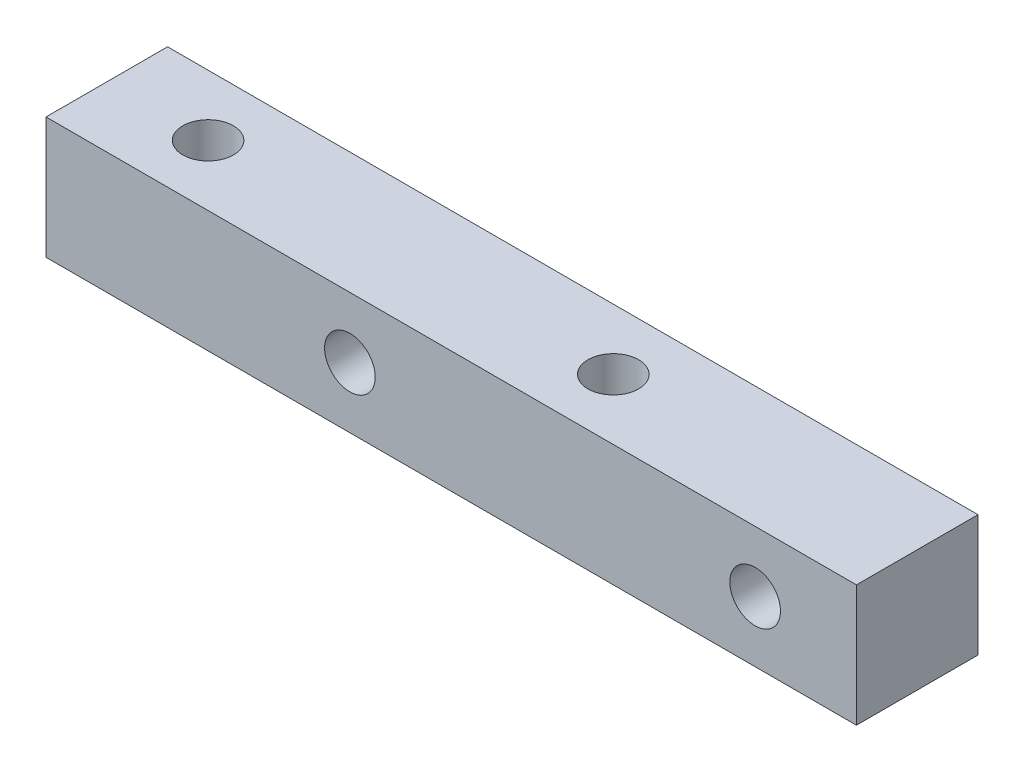
ISO-10303-21;
HEADER;
FILE_DESCRIPTION(('STEP AP214'),'2;1');
FILE_NAME('part.step','',(''),(''),'','','');
FILE_SCHEMA(('AUTOMOTIVE_DESIGN { 1 0 10303 214 1 1 1 1 }'));
ENDSEC;
DATA;
#1=APPLICATION_CONTEXT('core data for automotive mechanical design processes');
#2=APPLICATION_PROTOCOL_DEFINITION('international standard','automotive_design',2000,#1);
#3=PRODUCT_CONTEXT('',#1,'mechanical');
#4=PRODUCT('Part','Part','',(#3));
#5=PRODUCT_RELATED_PRODUCT_CATEGORY('part','',(#4));
#6=PRODUCT_DEFINITION_FORMATION('','',#4);
#7=PRODUCT_DEFINITION_CONTEXT('part definition',#1,'design');
#8=PRODUCT_DEFINITION('design','',#6,#7);
#9=PRODUCT_DEFINITION_SHAPE('','',#8);
#10=(LENGTH_UNIT() NAMED_UNIT(*) SI_UNIT(.MILLI.,.METRE.));
#11=(NAMED_UNIT(*) PLANE_ANGLE_UNIT() SI_UNIT($,.RADIAN.));
#12=(NAMED_UNIT(*) SI_UNIT($,.STERADIAN.) SOLID_ANGLE_UNIT());
#13=UNCERTAINTY_MEASURE_WITH_UNIT(LENGTH_MEASURE(1.E-05),#10,'distance_accuracy_value','');
#14=(GEOMETRIC_REPRESENTATION_CONTEXT(3) GLOBAL_UNCERTAINTY_ASSIGNED_CONTEXT((#13)) GLOBAL_UNIT_ASSIGNED_CONTEXT((#10,
#11,#12)) REPRESENTATION_CONTEXT('',''));
#15=CARTESIAN_POINT('',(0.,0.,0.));
#16=DIRECTION('',(0.,0.,1.));
#17=DIRECTION('',(1.,0.,0.));
#18=AXIS2_PLACEMENT_3D('',#15,#16,#17);
#19=CARTESIAN_POINT('',(0.,6.,0.));
#20=DIRECTION('',(0.,-1.,0.));
#21=DIRECTION('',(0.,0.,-1.));
#22=AXIS2_PLACEMENT_3D('',#19,#20,#21);
#23=PLANE('',#22);
#24=DIRECTION('',(0.,0.,-1.));
#25=VECTOR('',#24,1.);
#26=CARTESIAN_POINT('',(35.,6.,3.));
#27=LINE('',#26,#25);
#28=CARTESIAN_POINT('',(35.,6.,3.));
#29=VERTEX_POINT('',#28);
#30=CARTESIAN_POINT('',(35.,6.,-3.));
#31=VERTEX_POINT('',#30);
#32=EDGE_CURVE('E85',#29,#31,#27,.T.);
#33=ORIENTED_EDGE('',*,*,#32,.T.);
#34=DIRECTION('',(-1.,0.,0.));
#35=VECTOR('',#34,1.);
#36=CARTESIAN_POINT('',(-5.,6.,-3.));
#37=LINE('',#36,#35);
#38=CARTESIAN_POINT('',(-5.,6.,-3.));
#39=VERTEX_POINT('',#38);
#40=EDGE_CURVE('E80',#31,#39,#37,.T.);
#41=ORIENTED_EDGE('',*,*,#40,.T.);
#42=DIRECTION('',(0.,0.,1.));
#43=VECTOR('',#42,1.);
#44=CARTESIAN_POINT('',(-5.,6.,3.));
#45=LINE('',#44,#43);
#46=CARTESIAN_POINT('',(-5.,6.,3.));
#47=VERTEX_POINT('',#46);
#48=EDGE_CURVE('E83',#39,#47,#45,.T.);
#49=ORIENTED_EDGE('',*,*,#48,.T.);
#50=DIRECTION('',(1.,0.,0.));
#51=VECTOR('',#50,1.);
#52=CARTESIAN_POINT('',(-5.,6.,3.));
#53=LINE('',#52,#51);
#54=EDGE_CURVE('E50',#47,#29,#53,.T.);
#55=ORIENTED_EDGE('',*,*,#54,.T.);
#56=EDGE_LOOP('',(#33,#41,#49,#55));
#57=FACE_BOUND('',#56,.T.);
#58=CARTESIAN_POINT('',(0.,6.,0.));
#59=DIRECTION('',(0.,1.,0.));
#60=DIRECTION('',(0.,0.,1.));
#61=AXIS2_PLACEMENT_3D('',#58,#59,#60);
#62=CIRCLE('',#61,1.25);
#63=CARTESIAN_POINT('',(0.,6.,1.25));
#64=VERTEX_POINT('',#63);
#65=EDGE_CURVE('E100',#64,#64,#62,.T.);
#66=ORIENTED_EDGE('',*,*,#65,.F.);
#67=EDGE_LOOP('',(#66));
#68=FACE_BOUND('',#67,.T.);
#69=CARTESIAN_POINT('',(20.,6.,0.));
#70=DIRECTION('',(0.,1.,0.));
#71=DIRECTION('',(0.,0.,1.));
#72=AXIS2_PLACEMENT_3D('',#69,#70,#71);
#73=CIRCLE('',#72,1.25);
#74=CARTESIAN_POINT('',(20.,6.,1.25));
#75=VERTEX_POINT('',#74);
#76=EDGE_CURVE('E115',#75,#75,#73,.T.);
#77=ORIENTED_EDGE('',*,*,#76,.F.);
#78=EDGE_LOOP('',(#77));
#79=FACE_BOUND('',#78,.T.);
#80=ADVANCED_FACE('F33',(#57,#68,#79),#23,.F.);
#81=CARTESIAN_POINT('',(0.,0.,0.));
#82=DIRECTION('',(0.,-1.,0.));
#83=DIRECTION('',(0.,0.,-1.));
#84=AXIS2_PLACEMENT_3D('',#81,#82,#83);
#85=PLANE('',#84);
#86=CARTESIAN_POINT('',(0.,0.,0.));
#87=DIRECTION('',(0.,1.,0.));
#88=DIRECTION('',(0.,0.,1.));
#89=AXIS2_PLACEMENT_3D('',#86,#87,#88);
#90=CIRCLE('',#89,1.25);
#91=CARTESIAN_POINT('',(0.,0.,1.25));
#92=VERTEX_POINT('',#91);
#93=EDGE_CURVE('E112',#92,#92,#90,.T.);
#94=ORIENTED_EDGE('',*,*,#93,.T.);
#95=EDGE_LOOP('',(#94));
#96=FACE_BOUND('',#95,.T.);
#97=DIRECTION('',(0.,0.,-1.));
#98=VECTOR('',#97,1.);
#99=CARTESIAN_POINT('',(35.,0.,3.));
#100=LINE('',#99,#98);
#101=CARTESIAN_POINT('',(35.,0.,3.));
#102=VERTEX_POINT('',#101);
#103=CARTESIAN_POINT('',(35.,0.,-3.));
#104=VERTEX_POINT('',#103);
#105=EDGE_CURVE('E97',#102,#104,#100,.T.);
#106=ORIENTED_EDGE('',*,*,#105,.F.);
#107=DIRECTION('',(1.,0.,0.));
#108=VECTOR('',#107,1.);
#109=CARTESIAN_POINT('',(-5.,0.,3.));
#110=LINE('',#109,#108);
#111=CARTESIAN_POINT('',(-5.,0.,3.));
#112=VERTEX_POINT('',#111);
#113=EDGE_CURVE('E73',#112,#102,#110,.T.);
#114=ORIENTED_EDGE('',*,*,#113,.F.);
#115=DIRECTION('',(0.,0.,1.));
#116=VECTOR('',#115,1.);
#117=CARTESIAN_POINT('',(-5.,0.,3.));
#118=LINE('',#117,#116);
#119=CARTESIAN_POINT('',(-5.,0.,-3.));
#120=VERTEX_POINT('',#119);
#121=EDGE_CURVE('E67',#120,#112,#118,.T.);
#122=ORIENTED_EDGE('',*,*,#121,.F.);
#123=DIRECTION('',(-1.,0.,0.));
#124=VECTOR('',#123,1.);
#125=CARTESIAN_POINT('',(-5.,0.,-3.));
#126=LINE('',#125,#124);
#127=EDGE_CURVE('E89',#104,#120,#126,.T.);
#128=ORIENTED_EDGE('',*,*,#127,.F.);
#129=EDGE_LOOP('',(#106,#114,#122,#128));
#130=FACE_BOUND('',#129,.T.);
#131=CARTESIAN_POINT('',(20.,0.,0.));
#132=DIRECTION('',(0.,1.,0.));
#133=DIRECTION('',(0.,0.,1.));
#134=AXIS2_PLACEMENT_3D('',#131,#132,#133);
#135=CIRCLE('',#134,1.25);
#136=CARTESIAN_POINT('',(20.,0.,1.25));
#137=VERTEX_POINT('',#136);
#138=EDGE_CURVE('E118',#137,#137,#135,.T.);
#139=ORIENTED_EDGE('',*,*,#138,.T.);
#140=EDGE_LOOP('',(#139));
#141=FACE_BOUND('',#140,.T.);
#142=ADVANCED_FACE('F108',(#96,#130,#141),#85,.T.);
#143=CARTESIAN_POINT('',(35.,6.,3.));
#144=DIRECTION('',(-1.,0.,0.));
#145=DIRECTION('',(0.,0.,1.));
#146=AXIS2_PLACEMENT_3D('',#143,#144,#145);
#147=PLANE('',#146);
#148=ORIENTED_EDGE('',*,*,#105,.T.);
#149=DIRECTION('',(0.,-1.,0.));
#150=VECTOR('',#149,1.);
#151=CARTESIAN_POINT('',(35.,6.,-3.));
#152=LINE('',#151,#150);
#153=EDGE_CURVE('E11',#31,#104,#152,.T.);
#154=ORIENTED_EDGE('',*,*,#153,.F.);
#155=ORIENTED_EDGE('',*,*,#32,.F.);
#156=DIRECTION('',(0.,-1.,0.));
#157=VECTOR('',#156,1.);
#158=CARTESIAN_POINT('',(35.,6.,3.));
#159=LINE('',#158,#157);
#160=EDGE_CURVE('E93',#29,#102,#159,.T.);
#161=ORIENTED_EDGE('',*,*,#160,.T.);
#162=EDGE_LOOP('',(#148,#154,#155,#161));
#163=FACE_BOUND('',#162,.T.);
#164=ADVANCED_FACE('F35',(#163),#147,.F.);
#165=CARTESIAN_POINT('',(-5.,6.,-3.));
#166=DIRECTION('',(0.,0.,1.));
#167=DIRECTION('',(1.,0.,0.));
#168=AXIS2_PLACEMENT_3D('',#165,#166,#167);
#169=PLANE('',#168);
#170=CARTESIAN_POINT('',(9.99999999999999,3.,-3.));
#171=DIRECTION('',(0.,0.,1.));
#172=DIRECTION('',(1.,0.,0.));
#173=AXIS2_PLACEMENT_3D('',#170,#171,#172);
#174=CIRCLE('',#173,1.25);
#175=CARTESIAN_POINT('',(11.25,3.,-3.));
#176=VERTEX_POINT('',#175);
#177=EDGE_CURVE('E121',#176,#176,#174,.T.);
#178=ORIENTED_EDGE('',*,*,#177,.T.);
#179=EDGE_LOOP('',(#178));
#180=FACE_BOUND('',#179,.T.);
#181=CARTESIAN_POINT('',(30.,3.,-3.));
#182=DIRECTION('',(0.,0.,1.));
#183=DIRECTION('',(1.,0.,0.));
#184=AXIS2_PLACEMENT_3D('',#181,#182,#183);
#185=CIRCLE('',#184,1.25);
#186=CARTESIAN_POINT('',(31.25,3.,-3.));
#187=VERTEX_POINT('',#186);
#188=EDGE_CURVE('E127',#187,#187,#185,.T.);
#189=ORIENTED_EDGE('',*,*,#188,.T.);
#190=EDGE_LOOP('',(#189));
#191=FACE_BOUND('',#190,.T.);
#192=ORIENTED_EDGE('',*,*,#127,.T.);
#193=DIRECTION('',(0.,-1.,0.));
#194=VECTOR('',#193,1.);
#195=CARTESIAN_POINT('',(-5.,6.,-3.));
#196=LINE('',#195,#194);
#197=EDGE_CURVE('E42',#39,#120,#196,.T.);
#198=ORIENTED_EDGE('',*,*,#197,.F.);
#199=ORIENTED_EDGE('',*,*,#40,.F.);
#200=ORIENTED_EDGE('',*,*,#153,.T.);
#201=EDGE_LOOP('',(#192,#198,#199,#200));
#202=FACE_BOUND('',#201,.T.);
#203=ADVANCED_FACE('F88',(#180,#191,#202),#169,.F.);
#204=CARTESIAN_POINT('',(-5.,6.,3.));
#205=DIRECTION('',(1.,0.,0.));
#206=DIRECTION('',(0.,0.,-1.));
#207=AXIS2_PLACEMENT_3D('',#204,#205,#206);
#208=PLANE('',#207);
#209=ORIENTED_EDGE('',*,*,#121,.T.);
#210=DIRECTION('',(0.,-1.,0.));
#211=VECTOR('',#210,1.);
#212=CARTESIAN_POINT('',(-5.,6.,3.));
#213=LINE('',#212,#211);
#214=EDGE_CURVE('E90',#47,#112,#213,.T.);
#215=ORIENTED_EDGE('',*,*,#214,.F.);
#216=ORIENTED_EDGE('',*,*,#48,.F.);
#217=ORIENTED_EDGE('',*,*,#197,.T.);
#218=EDGE_LOOP('',(#209,#215,#216,#217));
#219=FACE_BOUND('',#218,.T.);
#220=ADVANCED_FACE('F91',(#219),#208,.F.);
#221=CARTESIAN_POINT('',(-5.,6.,3.));
#222=DIRECTION('',(0.,0.,-1.));
#223=DIRECTION('',(-1.,0.,0.));
#224=AXIS2_PLACEMENT_3D('',#221,#222,#223);
#225=PLANE('',#224);
#226=CARTESIAN_POINT('',(9.99999999999999,3.,3.));
#227=DIRECTION('',(0.,0.,1.));
#228=DIRECTION('',(1.,0.,0.));
#229=AXIS2_PLACEMENT_3D('',#226,#227,#228);
#230=CIRCLE('',#229,1.25);
#231=CARTESIAN_POINT('',(11.25,3.,3.));
#232=VERTEX_POINT('',#231);
#233=EDGE_CURVE('E130',#232,#232,#230,.T.);
#234=ORIENTED_EDGE('',*,*,#233,.F.);
#235=EDGE_LOOP('',(#234));
#236=FACE_BOUND('',#235,.T.);
#237=CARTESIAN_POINT('',(30.,3.,3.));
#238=DIRECTION('',(0.,0.,1.));
#239=DIRECTION('',(1.,0.,0.));
#240=AXIS2_PLACEMENT_3D('',#237,#238,#239);
#241=CIRCLE('',#240,1.25);
#242=CARTESIAN_POINT('',(31.25,3.,3.));
#243=VERTEX_POINT('',#242);
#244=EDGE_CURVE('E124',#243,#243,#241,.T.);
#245=ORIENTED_EDGE('',*,*,#244,.F.);
#246=EDGE_LOOP('',(#245));
#247=FACE_BOUND('',#246,.T.);
#248=ORIENTED_EDGE('',*,*,#113,.T.);
#249=ORIENTED_EDGE('',*,*,#160,.F.);
#250=ORIENTED_EDGE('',*,*,#54,.F.);
#251=ORIENTED_EDGE('',*,*,#214,.T.);
#252=EDGE_LOOP('',(#248,#249,#250,#251));
#253=FACE_BOUND('',#252,.T.);
#254=ADVANCED_FACE('F105',(#236,#247,#253),#225,.F.);
#255=CARTESIAN_POINT('',(0.,6.,0.));
#256=DIRECTION('',(0.,-1.,0.));
#257=DIRECTION('',(0.,0.,-1.));
#258=AXIS2_PLACEMENT_3D('',#255,#256,#257);
#259=CYLINDRICAL_SURFACE('',#258,1.25);
#260=ORIENTED_EDGE('',*,*,#65,.T.);
#261=EDGE_LOOP('',(#260));
#262=FACE_BOUND('',#261,.T.);
#263=ORIENTED_EDGE('',*,*,#93,.F.);
#264=EDGE_LOOP('',(#263));
#265=FACE_BOUND('',#264,.T.);
#266=ADVANCED_FACE('F147',(#262,#265),#259,.F.);
#267=CARTESIAN_POINT('',(20.,6.,0.));
#268=DIRECTION('',(0.,-1.,0.));
#269=DIRECTION('',(0.,0.,-1.));
#270=AXIS2_PLACEMENT_3D('',#267,#268,#269);
#271=CYLINDRICAL_SURFACE('',#270,1.25);
#272=ORIENTED_EDGE('',*,*,#76,.T.);
#273=EDGE_LOOP('',(#272));
#274=FACE_BOUND('',#273,.T.);
#275=ORIENTED_EDGE('',*,*,#138,.F.);
#276=EDGE_LOOP('',(#275));
#277=FACE_BOUND('',#276,.T.);
#278=ADVANCED_FACE('F152',(#274,#277),#271,.F.);
#279=CARTESIAN_POINT('',(30.,3.,-3.));
#280=DIRECTION('',(0.,0.,1.));
#281=DIRECTION('',(1.,0.,0.));
#282=AXIS2_PLACEMENT_3D('',#279,#280,#281);
#283=CYLINDRICAL_SURFACE('',#282,1.25);
#284=ORIENTED_EDGE('',*,*,#188,.F.);
#285=EDGE_LOOP('',(#284));
#286=FACE_BOUND('',#285,.T.);
#287=ORIENTED_EDGE('',*,*,#244,.T.);
#288=EDGE_LOOP('',(#287));
#289=FACE_BOUND('',#288,.T.);
#290=ADVANCED_FACE('F141',(#286,#289),#283,.F.);
#291=CARTESIAN_POINT('',(9.99999999999999,3.,-3.));
#292=DIRECTION('',(0.,0.,1.));
#293=DIRECTION('',(1.,0.,0.));
#294=AXIS2_PLACEMENT_3D('',#291,#292,#293);
#295=CYLINDRICAL_SURFACE('',#294,1.25);
#296=ORIENTED_EDGE('',*,*,#177,.F.);
#297=EDGE_LOOP('',(#296));
#298=FACE_BOUND('',#297,.T.);
#299=ORIENTED_EDGE('',*,*,#233,.T.);
#300=EDGE_LOOP('',(#299));
#301=FACE_BOUND('',#300,.T.);
#302=ADVANCED_FACE('F138',(#298,#301),#295,.F.);
#303=CLOSED_SHELL('',(#80,#142,#164,#203,#220,#254,#266,#278,#290,#302));
#304=MANIFOLD_SOLID_BREP('B2',#303);
#305=ADVANCED_BREP_SHAPE_REPRESENTATION('',(#18,#304),#14);
#306=SHAPE_DEFINITION_REPRESENTATION(#9,#305);
ENDSEC;
END-ISO-10303-21;
